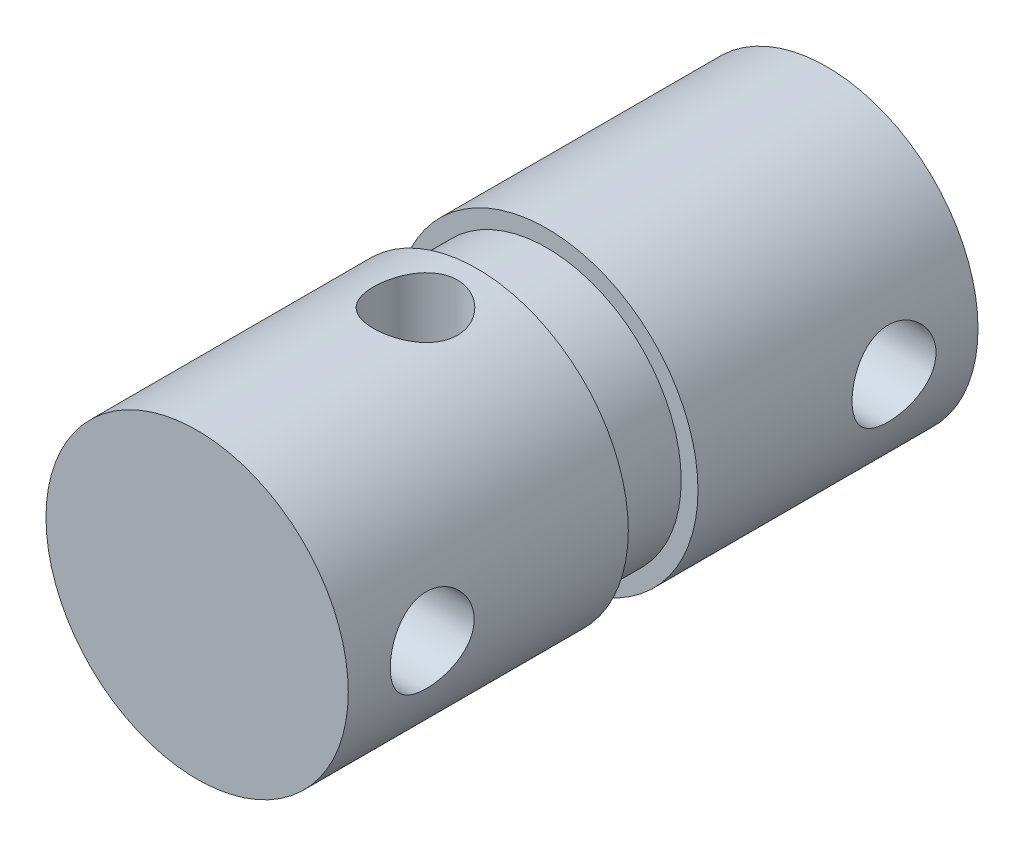
ISO-10303-21;
HEADER;
FILE_DESCRIPTION(('STEP AP214'),'2;1');
FILE_NAME('part.step','',(''),(''),'','','');
FILE_SCHEMA(('AUTOMOTIVE_DESIGN { 1 0 10303 214 1 1 1 1 }'));
ENDSEC;
DATA;
#1=APPLICATION_CONTEXT('core data for automotive mechanical design processes');
#2=APPLICATION_PROTOCOL_DEFINITION('international standard','automotive_design',2000,#1);
#3=PRODUCT_CONTEXT('',#1,'mechanical');
#4=PRODUCT('Part','Part','',(#3));
#5=PRODUCT_RELATED_PRODUCT_CATEGORY('part','',(#4));
#6=PRODUCT_DEFINITION_FORMATION('','',#4);
#7=PRODUCT_DEFINITION_CONTEXT('part definition',#1,'design');
#8=PRODUCT_DEFINITION('design','',#6,#7);
#9=PRODUCT_DEFINITION_SHAPE('','',#8);
#10=(LENGTH_UNIT() NAMED_UNIT(*) SI_UNIT(.MILLI.,.METRE.));
#11=(NAMED_UNIT(*) PLANE_ANGLE_UNIT() SI_UNIT($,.RADIAN.));
#12=(NAMED_UNIT(*) SI_UNIT($,.STERADIAN.) SOLID_ANGLE_UNIT());
#13=UNCERTAINTY_MEASURE_WITH_UNIT(LENGTH_MEASURE(1.E-05),#10,'distance_accuracy_value','');
#14=(GEOMETRIC_REPRESENTATION_CONTEXT(3) GLOBAL_UNCERTAINTY_ASSIGNED_CONTEXT((#13)) GLOBAL_UNIT_ASSIGNED_CONTEXT((#10,
#11,#12)) REPRESENTATION_CONTEXT('',''));
#15=CARTESIAN_POINT('',(0.,0.,0.));
#16=DIRECTION('',(0.,0.,1.));
#17=DIRECTION('',(1.,0.,0.));
#18=AXIS2_PLACEMENT_3D('',#15,#16,#17);
#19=CARTESIAN_POINT('',(0.,0.,0.));
#20=DIRECTION('',(0.,0.,-1.));
#21=DIRECTION('',(-1.,0.,0.));
#22=AXIS2_PLACEMENT_3D('',#19,#20,#21);
#23=CYLINDRICAL_SURFACE('',#22,4.572);
#24=CARTESIAN_POINT('',(0.,-4.572,13.716));
#25=CARTESIAN_POINT('',(0.0699020708973099,-4.571999065452,13.7159985780214));
#26=CARTESIAN_POINT('',(0.13981899773271,-4.57038124872222,13.7102094910778));
#27=CARTESIAN_POINT('',(0.277631627610146,-4.56408485401408,13.6872515400824));
#28=CARTESIAN_POINT('',(0.345526465322054,-4.55940498479641,13.6700778752189));
#29=CARTESIAN_POINT('',(0.477286268875187,-4.54749982440908,13.6249575410755));
#30=CARTESIAN_POINT('',(0.541156540337201,-4.54027797079459,13.5970254158024));
#31=CARTESIAN_POINT('',(0.663306466365641,-4.52404797583308,13.5312368375719));
#32=CARTESIAN_POINT('',(0.721585623945294,-4.51503967590907,13.49337950349));
#33=CARTESIAN_POINT('',(0.832354733271379,-4.4959540034257,13.4078172952157));
#34=CARTESIAN_POINT('',(0.88468516261341,-4.48585715601675,13.3599102476775));
#35=CARTESIAN_POINT('',(0.980681996667479,-4.46585448831132,13.2560402624445));
#36=CARTESIAN_POINT('',(1.02434718253907,-4.4559486950649,13.2000761933684));
#37=CARTESIAN_POINT('',(1.10257141517609,-4.4372483700326,13.0803830237086));
#38=CARTESIAN_POINT('',(1.13694336947003,-4.4284782951312,13.0165274762212));
#39=CARTESIAN_POINT('',(1.19439900445238,-4.41333027221237,12.8836603716776));
#40=CARTESIAN_POINT('',(1.21748496493622,-4.40695184113836,12.8146498591853));
#41=CARTESIAN_POINT('',(1.25115243157843,-4.39751097273163,12.6752067665242));
#42=CARTESIAN_POINT('',(1.26202477494765,-4.3943715617925,12.6048497492139));
#43=CARTESIAN_POINT('',(1.2718636191122,-4.39153451774961,12.4632457002682));
#44=CARTESIAN_POINT('',(1.2708325513174,-4.3918361817662,12.3919988533607));
#45=CARTESIAN_POINT('',(1.25712394079022,-4.39577852670277,12.2529373648177));
#46=CARTESIAN_POINT('',(1.24480220707002,-4.39931719239283,12.1850842896798));
#47=CARTESIAN_POINT('',(1.20943350901136,-4.40917093326331,12.0524487133509));
#48=CARTESIAN_POINT('',(1.18638562272472,-4.41548624710322,11.9876664766361));
#49=CARTESIAN_POINT('',(1.12993803104617,-4.43026870892164,11.8621025328414));
#50=CARTESIAN_POINT('',(1.09641662186383,-4.438760932978,11.801378615321));
#51=CARTESIAN_POINT('',(1.0200583173051,-4.45692733895248,11.6862945591993));
#52=CARTESIAN_POINT('',(0.977219448951252,-4.46660177101345,11.6319357721742));
#53=CARTESIAN_POINT('',(0.881639700048992,-4.48646369280857,11.5290966974766));
#54=CARTESIAN_POINT('',(0.828601116177594,-4.49665719958396,11.4808938429621));
#55=CARTESIAN_POINT('',(0.715067512916252,-4.51610171007802,11.3940074575297));
#56=CARTESIAN_POINT('',(0.654572148228716,-4.52535267011436,11.3553243676879));
#57=CARTESIAN_POINT('',(0.527388764207524,-4.54193493148159,11.2884388753198));
#58=CARTESIAN_POINT('',(0.460671058079712,-4.5492563182386,11.2602903023981));
#59=CARTESIAN_POINT('',(0.323199748590031,-4.56108300381469,11.2156909559836));
#60=CARTESIAN_POINT('',(0.25244710914707,-4.56558897216879,11.1992374011689));
#61=CARTESIAN_POINT('',(0.111279033436553,-4.57117436267143,11.1789391490326));
#62=CARTESIAN_POINT('',(0.0409217427524207,-4.57235614685215,11.1747176607743));
#63=CARTESIAN_POINT('',(-0.0994968095267519,-4.5714562397785,11.1779578302651));
#64=CARTESIAN_POINT('',(-0.16955810364107,-4.56937491689018,11.1854181692744));
#65=CARTESIAN_POINT('',(-0.306026224086394,-4.56224909299973,11.2115024274656));
#66=CARTESIAN_POINT('',(-0.372477068774489,-4.55726126562262,11.2299129681784));
#67=CARTESIAN_POINT('',(-0.50133820800862,-4.54489138436064,11.2771243775203));
#68=CARTESIAN_POINT('',(-0.56374804595594,-4.53750906048279,11.3059264178906));
#69=CARTESIAN_POINT('',(-0.684194862651903,-4.52093320128722,11.3737805320952));
#70=CARTESIAN_POINT('',(-0.742113894944799,-4.51170518882014,11.4130333327118));
#71=CARTESIAN_POINT('',(-0.850674113316392,-4.49250284762264,11.5004251939804));
#72=CARTESIAN_POINT('',(-0.901313731665477,-4.48252835882872,11.5485661637468));
#73=CARTESIAN_POINT('',(-0.99548901937607,-4.46257520167329,11.6541310669804));
#74=CARTESIAN_POINT('',(-1.03875797211549,-4.45260585939287,11.7117951707825));
#75=CARTESIAN_POINT('',(-1.11501510731872,-4.43412568397135,11.8337793680858));
#76=CARTESIAN_POINT('',(-1.14800368298183,-4.42561479505358,11.8980992068961));
#77=CARTESIAN_POINT('',(-1.202518355275,-4.41111435739472,12.0312760846013));
#78=CARTESIAN_POINT('',(-1.22410806724539,-4.40511085545577,12.1001054799587));
#79=CARTESIAN_POINT('',(-1.25534574935282,-4.39631202923068,12.2406153047674));
#80=CARTESIAN_POINT('',(-1.26499709313078,-4.39351579862405,12.3122949228672));
#81=CARTESIAN_POINT('',(-1.27187817733911,-4.39152830943153,12.4537274719626));
#82=CARTESIAN_POINT('',(-1.26953844150815,-4.39221209908555,12.5234580010521));
#83=CARTESIAN_POINT('',(-1.25351177579854,-4.39681251244957,12.6614884120954));
#84=CARTESIAN_POINT('',(-1.23982518658201,-4.40072903910437,12.7297883369365));
#85=CARTESIAN_POINT('',(-1.20175247836593,-4.41127610308931,12.8624251096608));
#86=CARTESIAN_POINT('',(-1.17746490075375,-4.41788160783887,12.9267923761301));
#87=CARTESIAN_POINT('',(-1.11895586897466,-4.43306114708886,13.0505885012674));
#88=CARTESIAN_POINT('',(-1.08473273892427,-4.44163551363682,13.1100165246295));
#89=CARTESIAN_POINT('',(-1.00605027341331,-4.46012631757945,13.2242840952704));
#90=CARTESIAN_POINT('',(-0.961300677695808,-4.47007669845978,13.2789183003097));
#91=CARTESIAN_POINT('',(-0.863378031889875,-4.49001725219912,13.3800416900063));
#92=CARTESIAN_POINT('',(-0.810202896358244,-4.50000743431116,13.4265288521372));
#93=CARTESIAN_POINT('',(-0.695411596024809,-4.51918669014853,13.5111318667633));
#94=CARTESIAN_POINT('',(-0.63362459907509,-4.52835102651876,13.5490220492837));
#95=CARTESIAN_POINT('',(-0.504303774415928,-4.54456774499014,13.6138189895181));
#96=CARTESIAN_POINT('',(-0.436773350659554,-4.55162136699901,13.6407321988783));
#97=CARTESIAN_POINT('',(-0.307995811506968,-4.56200332029261,13.6796476020265));
#98=CARTESIAN_POINT('',(-0.247258232603442,-4.56572361592445,13.6932464641944));
#99=CARTESIAN_POINT('',(-0.124350907704504,-4.57072222735905,13.7114227633557));
#100=CARTESIAN_POINT('',(-0.062181331587726,-4.57200083132643,13.7160012649199));
#101=CARTESIAN_POINT('',(0.,-4.572,13.716));
#102=B_SPLINE_CURVE_WITH_KNOTS('',3,(#24,#25,#26,#27,#28,#29,#30,#31,#32,#33,#34,#35,#36,#37,
#38,#39,#40,#41,#42,#43,#44,#45,#46,#47,#48,#49,#50,#51,#52,#53,#54,#55,#56,#57,#58,#59,#60,#61,
#62,#63,#64,#65,#66,#67,#68,#69,#70,#71,#72,#73,#74,#75,#76,#77,#78,#79,#80,#81,#82,#83,#84,#85,
#86,#87,#88,#89,#90,#91,#92,#93,#94,#95,#96,#97,#98,#99,#100,#101),.UNSPECIFIED.,.T.,.F.,(4,2,2,
2,2,2,2,2,2,2,2,2,2,2,2,2,2,2,2,2,2,2,2,2,2,2,2,2,2,2,2,2,2,2,2,2,2,2,4),(0.,0.209478060189082,
0.419044512325617,0.628328647269941,0.837631368003338,1.05163746314468,1.26567363876699,
1.48374293368851,1.70176815991518,1.91448366850216,2.12715572824691,2.33334796718268,
2.53955793229539,2.74825927401306,2.95700485146158,3.17316605739572,3.38933727676676,
3.60659848286125,3.82380800235607,4.03425162757841,4.24467149792453,4.45111954557126,
4.65759087949647,4.86835652066374,5.07916748554579,5.29646887570096,5.51376195358892,
5.72982917891636,5.94583533225543,6.15414160832217,6.36244163071789,6.56884531852922,
6.77528384181699,6.98827063886151,7.2013102358127,7.41942220034088,7.63740578557666,
7.82376882309431,8.01010986497998),.UNSPECIFIED.);
#103=CARTESIAN_POINT('',(0.,-4.572,13.716));
#104=VERTEX_POINT('',#103);
#105=EDGE_CURVE('E111',#104,#104,#102,.T.);
#106=ORIENTED_EDGE('',*,*,#105,.T.);
#107=EDGE_LOOP('',(#106));
#108=FACE_BOUND('',#107,.T.);
#109=CARTESIAN_POINT('',(0.,4.572,13.716));
#110=CARTESIAN_POINT('',(-0.0699020708973099,4.571999065452,13.7159985780214));
#111=CARTESIAN_POINT('',(-0.13981899773271,4.57038124872222,13.7102094910778));
#112=CARTESIAN_POINT('',(-0.277631627610146,4.56408485401408,13.6872515400824));
#113=CARTESIAN_POINT('',(-0.345526465322054,4.55940498479641,13.6700778752189));
#114=CARTESIAN_POINT('',(-0.477286268875187,4.54749982440908,13.6249575410755));
#115=CARTESIAN_POINT('',(-0.541156540337201,4.54027797079459,13.5970254158024));
#116=CARTESIAN_POINT('',(-0.663306466365641,4.52404797583308,13.5312368375719));
#117=CARTESIAN_POINT('',(-0.721585623945294,4.51503967590907,13.49337950349));
#118=CARTESIAN_POINT('',(-0.832354733271379,4.4959540034257,13.4078172952157));
#119=CARTESIAN_POINT('',(-0.88468516261341,4.48585715601675,13.3599102476775));
#120=CARTESIAN_POINT('',(-0.980681996667479,4.46585448831132,13.2560402624445));
#121=CARTESIAN_POINT('',(-1.02434718253907,4.4559486950649,13.2000761933684));
#122=CARTESIAN_POINT('',(-1.10257141517609,4.4372483700326,13.0803830237086));
#123=CARTESIAN_POINT('',(-1.13694336947003,4.4284782951312,13.0165274762212));
#124=CARTESIAN_POINT('',(-1.19439900445238,4.41333027221237,12.8836603716776));
#125=CARTESIAN_POINT('',(-1.21748496493622,4.40695184113836,12.8146498591853));
#126=CARTESIAN_POINT('',(-1.25115243157843,4.39751097273163,12.6752067665242));
#127=CARTESIAN_POINT('',(-1.26202477494765,4.3943715617925,12.6048497492139));
#128=CARTESIAN_POINT('',(-1.2718636191122,4.39153451774961,12.4632457002682));
#129=CARTESIAN_POINT('',(-1.2708325513174,4.3918361817662,12.3919988533607));
#130=CARTESIAN_POINT('',(-1.25712394079022,4.39577852670277,12.2529373648177));
#131=CARTESIAN_POINT('',(-1.24480220707002,4.39931719239283,12.1850842896798));
#132=CARTESIAN_POINT('',(-1.20943350901136,4.40917093326331,12.0524487133509));
#133=CARTESIAN_POINT('',(-1.18638562272472,4.41548624710322,11.9876664766361));
#134=CARTESIAN_POINT('',(-1.12993803104617,4.43026870892164,11.8621025328414));
#135=CARTESIAN_POINT('',(-1.09641662186383,4.438760932978,11.801378615321));
#136=CARTESIAN_POINT('',(-1.0200583173051,4.45692733895248,11.6862945591993));
#137=CARTESIAN_POINT('',(-0.977219448951252,4.46660177101345,11.6319357721742));
#138=CARTESIAN_POINT('',(-0.881639700048992,4.48646369280857,11.5290966974766));
#139=CARTESIAN_POINT('',(-0.828601116177594,4.49665719958396,11.4808938429621));
#140=CARTESIAN_POINT('',(-0.715067512916252,4.51610171007802,11.3940074575297));
#141=CARTESIAN_POINT('',(-0.654572148228716,4.52535267011436,11.3553243676879));
#142=CARTESIAN_POINT('',(-0.527388764207524,4.54193493148159,11.2884388753198));
#143=CARTESIAN_POINT('',(-0.460671058079712,4.5492563182386,11.2602903023981));
#144=CARTESIAN_POINT('',(-0.323199748590031,4.56108300381469,11.2156909559836));
#145=CARTESIAN_POINT('',(-0.25244710914707,4.56558897216879,11.1992374011689));
#146=CARTESIAN_POINT('',(-0.111279033436553,4.57117436267143,11.1789391490326));
#147=CARTESIAN_POINT('',(-0.0409217427524207,4.57235614685215,11.1747176607743));
#148=CARTESIAN_POINT('',(0.0994968095267519,4.5714562397785,11.1779578302651));
#149=CARTESIAN_POINT('',(0.16955810364107,4.56937491689018,11.1854181692744));
#150=CARTESIAN_POINT('',(0.306026224086394,4.56224909299973,11.2115024274656));
#151=CARTESIAN_POINT('',(0.372477068774489,4.55726126562262,11.2299129681784));
#152=CARTESIAN_POINT('',(0.50133820800862,4.54489138436064,11.2771243775203));
#153=CARTESIAN_POINT('',(0.56374804595594,4.53750906048279,11.3059264178906));
#154=CARTESIAN_POINT('',(0.684194862651903,4.52093320128722,11.3737805320952));
#155=CARTESIAN_POINT('',(0.742113894944799,4.51170518882014,11.4130333327118));
#156=CARTESIAN_POINT('',(0.850674113316392,4.49250284762264,11.5004251939804));
#157=CARTESIAN_POINT('',(0.901313731665477,4.48252835882872,11.5485661637468));
#158=CARTESIAN_POINT('',(0.99548901937607,4.46257520167329,11.6541310669804));
#159=CARTESIAN_POINT('',(1.03875797211549,4.45260585939287,11.7117951707825));
#160=CARTESIAN_POINT('',(1.11501510731872,4.43412568397135,11.8337793680858));
#161=CARTESIAN_POINT('',(1.14800368298183,4.42561479505358,11.8980992068961));
#162=CARTESIAN_POINT('',(1.202518355275,4.41111435739472,12.0312760846013));
#163=CARTESIAN_POINT('',(1.22410806724539,4.40511085545577,12.1001054799587));
#164=CARTESIAN_POINT('',(1.25534574935282,4.39631202923068,12.2406153047674));
#165=CARTESIAN_POINT('',(1.26499709313078,4.39351579862405,12.3122949228672));
#166=CARTESIAN_POINT('',(1.27187817733911,4.39152830943153,12.4537274719626));
#167=CARTESIAN_POINT('',(1.26953844150815,4.39221209908555,12.5234580010521));
#168=CARTESIAN_POINT('',(1.25351177579854,4.39681251244957,12.6614884120954));
#169=CARTESIAN_POINT('',(1.23982518658201,4.40072903910437,12.7297883369365));
#170=CARTESIAN_POINT('',(1.20175247836593,4.41127610308931,12.8624251096608));
#171=CARTESIAN_POINT('',(1.17746490075375,4.41788160783887,12.9267923761301));
#172=CARTESIAN_POINT('',(1.11895586897466,4.43306114708886,13.0505885012674));
#173=CARTESIAN_POINT('',(1.08473273892427,4.44163551363682,13.1100165246295));
#174=CARTESIAN_POINT('',(1.00605027341331,4.46012631757945,13.2242840952704));
#175=CARTESIAN_POINT('',(0.961300677695808,4.47007669845978,13.2789183003097));
#176=CARTESIAN_POINT('',(0.863378031889875,4.49001725219912,13.3800416900063));
#177=CARTESIAN_POINT('',(0.810202896358244,4.50000743431116,13.4265288521372));
#178=CARTESIAN_POINT('',(0.695411596024809,4.51918669014853,13.5111318667633));
#179=CARTESIAN_POINT('',(0.63362459907509,4.52835102651876,13.5490220492837));
#180=CARTESIAN_POINT('',(0.504303774415928,4.54456774499014,13.6138189895181));
#181=CARTESIAN_POINT('',(0.436773350659554,4.55162136699901,13.6407321988783));
#182=CARTESIAN_POINT('',(0.307995811506968,4.56200332029261,13.6796476020265));
#183=CARTESIAN_POINT('',(0.247258232603442,4.56572361592445,13.6932464641944));
#184=CARTESIAN_POINT('',(0.124350907704504,4.57072222735905,13.7114227633557));
#185=CARTESIAN_POINT('',(0.062181331587726,4.57200083132643,13.7160012649199));
#186=CARTESIAN_POINT('',(0.,4.572,13.716));
#187=B_SPLINE_CURVE_WITH_KNOTS('',3,(#109,#110,#111,#112,#113,#114,#115,#116,#117,#118,#119,
#120,#121,#122,#123,#124,#125,#126,#127,#128,#129,#130,#131,#132,#133,#134,#135,#136,#137,#138,
#139,#140,#141,#142,#143,#144,#145,#146,#147,#148,#149,#150,#151,#152,#153,#154,#155,#156,#157,
#158,#159,#160,#161,#162,#163,#164,#165,#166,#167,#168,#169,#170,#171,#172,#173,#174,#175,#176,
#177,#178,#179,#180,#181,#182,#183,#184,#185,#186),.UNSPECIFIED.,.T.,.F.,(4,2,2,2,2,2,2,2,2,2,2,
2,2,2,2,2,2,2,2,2,2,2,2,2,2,2,2,2,2,2,2,2,2,2,2,2,2,2,4),(0.,0.209478060189082,
0.419044512325617,0.628328647269941,0.837631368003338,1.05163746314468,1.26567363876699,
1.48374293368851,1.70176815991518,1.91448366850216,2.12715572824691,2.33334796718268,
2.53955793229539,2.74825927401306,2.95700485146158,3.17316605739572,3.38933727676676,
3.60659848286125,3.82380800235607,4.03425162757841,4.24467149792453,4.45111954557126,
4.65759087949647,4.86835652066374,5.07916748554579,5.29646887570096,5.51376195358892,
5.72982917891636,5.94583533225543,6.15414160832217,6.36244163071789,6.56884531852922,
6.77528384181699,6.98827063886151,7.2013102358127,7.41942220034088,7.63740578557666,
7.82376882309431,8.01010986497998),.UNSPECIFIED.);
#188=CARTESIAN_POINT('',(0.,4.572,13.716));
#189=VERTEX_POINT('',#188);
#190=EDGE_CURVE('E105',#189,#189,#187,.T.);
#191=ORIENTED_EDGE('',*,*,#190,.T.);
#192=EDGE_LOOP('',(#191));
#193=FACE_BOUND('',#192,.T.);
#194=CARTESIAN_POINT('',(0.,0.,10.5791));
#195=DIRECTION('',(0.,0.,-1.));
#196=DIRECTION('',(-1.,0.,0.));
#197=AXIS2_PLACEMENT_3D('',#194,#195,#196);
#198=CIRCLE('',#197,4.572);
#199=CARTESIAN_POINT('',(-4.572,0.,10.5791));
#200=VERTEX_POINT('',#199);
#201=EDGE_CURVE('E146',#200,#200,#198,.T.);
#202=ORIENTED_EDGE('',*,*,#201,.F.);
#203=EDGE_LOOP('',(#202));
#204=FACE_BOUND('',#203,.T.);
#205=CARTESIAN_POINT('',(0.,0.,19.05));
#206=DIRECTION('',(0.,0.,-1.));
#207=DIRECTION('',(-1.,0.,0.));
#208=AXIS2_PLACEMENT_3D('',#205,#206,#207);
#209=CIRCLE('',#208,4.572);
#210=CARTESIAN_POINT('',(-4.572,0.,19.05));
#211=VERTEX_POINT('',#210);
#212=EDGE_CURVE('E150',#211,#211,#209,.T.);
#213=ORIENTED_EDGE('',*,*,#212,.T.);
#214=EDGE_LOOP('',(#213));
#215=FACE_BOUND('',#214,.T.);
#216=CARTESIAN_POINT('',(4.572,0.,15.24));
#217=CARTESIAN_POINT('',(4.571999065452,0.06990207089731,15.2400014219786));
#218=CARTESIAN_POINT('',(4.57038124872222,0.13981899773271,15.2457905089222));
#219=CARTESIAN_POINT('',(4.56408485401408,0.277631627610146,15.2687484599176));
#220=CARTESIAN_POINT('',(4.55940498479641,0.345526465322054,15.2859221247811));
#221=CARTESIAN_POINT('',(4.54749982440908,0.477286268875186,15.3310424589245));
#222=CARTESIAN_POINT('',(4.54027797079459,0.5411565403372,15.3589745841976));
#223=CARTESIAN_POINT('',(4.52404797583308,0.66330646636564,15.4247631624281));
#224=CARTESIAN_POINT('',(4.51503967590907,0.721585623945294,15.46262049651));
#225=CARTESIAN_POINT('',(4.4959540034257,0.832354733271379,15.5481827047843));
#226=CARTESIAN_POINT('',(4.48585715601675,0.88468516261341,15.5960897523225));
#227=CARTESIAN_POINT('',(4.46585448831132,0.98068199666748,15.6999597375555));
#228=CARTESIAN_POINT('',(4.4559486950649,1.02434718253907,15.7559238066316));
#229=CARTESIAN_POINT('',(4.4372483700326,1.10257141517609,15.8756169762914));
#230=CARTESIAN_POINT('',(4.4284782951312,1.13694336947003,15.9394725237788));
#231=CARTESIAN_POINT('',(4.41333027221237,1.19439900445238,16.0723396283224));
#232=CARTESIAN_POINT('',(4.40695184113836,1.21748496493622,16.1413501408147));
#233=CARTESIAN_POINT('',(4.39751097273163,1.25115243157843,16.2807932334758));
#234=CARTESIAN_POINT('',(4.39437156179249,1.26202477494765,16.3511502507861));
#235=CARTESIAN_POINT('',(4.3915345177496,1.2718636191122,16.4927542997318));
#236=CARTESIAN_POINT('',(4.3918361817662,1.2708325513174,16.5640011466393));
#237=CARTESIAN_POINT('',(4.39577852670277,1.25712394079022,16.7030626351823));
#238=CARTESIAN_POINT('',(4.39931719239283,1.24480220707002,16.7709157103201));
#239=CARTESIAN_POINT('',(4.40917093326331,1.20943350901136,16.9035512866491));
#240=CARTESIAN_POINT('',(4.41548624710322,1.18638562272472,16.9683335233639));
#241=CARTESIAN_POINT('',(4.43026870892164,1.12993803104617,17.0938974671586));
#242=CARTESIAN_POINT('',(4.438760932978,1.09641662186383,17.154621384679));
#243=CARTESIAN_POINT('',(4.45692733895248,1.0200583173051,17.2697054408007));
#244=CARTESIAN_POINT('',(4.46660177101345,0.977219448951252,17.3240642278258));
#245=CARTESIAN_POINT('',(4.48646369280857,0.881639700048992,17.4269033025234));
#246=CARTESIAN_POINT('',(4.49665719958396,0.828601116177594,17.4751061570379));
#247=CARTESIAN_POINT('',(4.51610171007802,0.715067512916252,17.5619925424703));
#248=CARTESIAN_POINT('',(4.52535267011436,0.654572148228716,17.6006756323121));
#249=CARTESIAN_POINT('',(4.54193493148159,0.527388764207524,17.6675611246802));
#250=CARTESIAN_POINT('',(4.5492563182386,0.460671058079711,17.6957096976019));
#251=CARTESIAN_POINT('',(4.56108300381469,0.323199748590031,17.7403090440164));
#252=CARTESIAN_POINT('',(4.56558897216879,0.252447109147069,17.7567625988311));
#253=CARTESIAN_POINT('',(4.57117436267143,0.111279033436553,17.7770608509674));
#254=CARTESIAN_POINT('',(4.57235614685215,0.0409217427524208,17.7812823392257));
#255=CARTESIAN_POINT('',(4.5714562397785,-0.0994968095267517,17.7780421697349));
#256=CARTESIAN_POINT('',(4.56937491689018,-0.16955810364107,17.7705818307256));
#257=CARTESIAN_POINT('',(4.56224909299973,-0.306026224086394,17.7444975725345));
#258=CARTESIAN_POINT('',(4.55726126562262,-0.372477068774489,17.7260870318216));
#259=CARTESIAN_POINT('',(4.54489138436064,-0.501338208008621,17.6788756224797));
#260=CARTESIAN_POINT('',(4.53750906048279,-0.56374804595594,17.6500735821094));
#261=CARTESIAN_POINT('',(4.52093320128722,-0.684194862651903,17.5822194679048));
#262=CARTESIAN_POINT('',(4.51170518882014,-0.742113894944799,17.5429666672882));
#263=CARTESIAN_POINT('',(4.49250284762264,-0.850674113316393,17.4555748060196));
#264=CARTESIAN_POINT('',(4.48252835882872,-0.901313731665478,17.4074338362532));
#265=CARTESIAN_POINT('',(4.46257520167329,-0.99548901937607,17.3018689330196));
#266=CARTESIAN_POINT('',(4.45260585939287,-1.03875797211549,17.2442048292175));
#267=CARTESIAN_POINT('',(4.43412568397135,-1.11501510731872,17.1222206319142));
#268=CARTESIAN_POINT('',(4.42561479505358,-1.14800368298183,17.0579007931039));
#269=CARTESIAN_POINT('',(4.41111435739472,-1.202518355275,16.9247239153987));
#270=CARTESIAN_POINT('',(4.40511085545577,-1.22410806724539,16.8558945200413));
#271=CARTESIAN_POINT('',(4.39631202923068,-1.25534574935282,16.7153846952326));
#272=CARTESIAN_POINT('',(4.39351579862405,-1.26499709313078,16.6437050771328));
#273=CARTESIAN_POINT('',(4.39152830943153,-1.27187817733911,16.5022725280374));
#274=CARTESIAN_POINT('',(4.39221209908555,-1.26953844150815,16.4325419989479));
#275=CARTESIAN_POINT('',(4.39681251244957,-1.25351177579855,16.2945115879046));
#276=CARTESIAN_POINT('',(4.40072903910437,-1.23982518658201,16.2262116630635));
#277=CARTESIAN_POINT('',(4.41127610308931,-1.20175247836592,16.0935748903392));
#278=CARTESIAN_POINT('',(4.41788160783887,-1.17746490075375,16.0292076238699));
#279=CARTESIAN_POINT('',(4.43306114708886,-1.11895586897466,15.9054114987326));
#280=CARTESIAN_POINT('',(4.44163551363682,-1.08473273892427,15.8459834753705));
#281=CARTESIAN_POINT('',(4.46012631757945,-1.00605027341331,15.7317159047296));
#282=CARTESIAN_POINT('',(4.47007669845978,-0.961300677695808,15.6770816996904));
#283=CARTESIAN_POINT('',(4.49001725219912,-0.863378031889875,15.5759583099937));
#284=CARTESIAN_POINT('',(4.50000743431116,-0.810202896358243,15.5294711478628));
#285=CARTESIAN_POINT('',(4.51918669014853,-0.695411596024809,15.4448681332367));
#286=CARTESIAN_POINT('',(4.52835102651876,-0.63362459907509,15.4069779507163));
#287=CARTESIAN_POINT('',(4.54456774499014,-0.504303774415928,15.3421810104819));
#288=CARTESIAN_POINT('',(4.55162136699901,-0.436773350659553,15.3152678011217));
#289=CARTESIAN_POINT('',(4.56200332029261,-0.307995811506968,15.2763523979735));
#290=CARTESIAN_POINT('',(4.56572361592445,-0.247258232603442,15.2627535358056));
#291=CARTESIAN_POINT('',(4.57072222735905,-0.124350907704504,15.2445772366443));
#292=CARTESIAN_POINT('',(4.57200083132643,-0.062181331587726,15.2399987350801));
#293=CARTESIAN_POINT('',(4.572,0.,15.24));
#294=B_SPLINE_CURVE_WITH_KNOTS('',3,(#216,#217,#218,#219,#220,#221,#222,#223,#224,#225,#226,
#227,#228,#229,#230,#231,#232,#233,#234,#235,#236,#237,#238,#239,#240,#241,#242,#243,#244,#245,
#246,#247,#248,#249,#250,#251,#252,#253,#254,#255,#256,#257,#258,#259,#260,#261,#262,#263,#264,
#265,#266,#267,#268,#269,#270,#271,#272,#273,#274,#275,#276,#277,#278,#279,#280,#281,#282,#283,
#284,#285,#286,#287,#288,#289,#290,#291,#292,#293),.UNSPECIFIED.,.T.,.F.,(4,2,2,2,2,2,2,2,2,2,2,
2,2,2,2,2,2,2,2,2,2,2,2,2,2,2,2,2,2,2,2,2,2,2,2,2,2,2,4),(0.,0.209478060189082,
0.419044512325617,0.62832864726994,0.837631368003339,1.05163746314468,1.26567363876699,
1.48374293368851,1.70176815991519,1.91448366850216,2.12715572824691,2.33334796718268,
2.5395579322954,2.74825927401306,2.95700485146158,3.17316605739572,3.38933727676677,
3.60659848286125,3.82380800235607,4.03425162757842,4.24467149792453,4.45111954557127,
4.65759087949648,4.86835652066374,5.0791674855458,5.29646887570097,5.51376195358892,
5.72982917891636,5.94583533225544,6.15414160832217,6.3624416307179,6.56884531852922,
6.775283841817,6.98827063886152,7.20131023581271,7.41942220034089,7.63740578557667,
7.82376882309431,8.01010986497998),.UNSPECIFIED.);
#295=CARTESIAN_POINT('',(4.572,0.,15.24));
#296=VERTEX_POINT('',#295);
#297=EDGE_CURVE('E66',#296,#296,#294,.T.);
#298=ORIENTED_EDGE('',*,*,#297,.F.);
#299=EDGE_LOOP('',(#298));
#300=FACE_BOUND('',#299,.T.);
#301=CARTESIAN_POINT('',(-4.572,0.,15.24));
#302=CARTESIAN_POINT('',(-4.571999065452,-0.0699020708973101,15.2400014219786));
#303=CARTESIAN_POINT('',(-4.57038124872222,-0.13981899773271,15.2457905089222));
#304=CARTESIAN_POINT('',(-4.56408485401408,-0.277631627610146,15.2687484599176));
#305=CARTESIAN_POINT('',(-4.55940498479641,-0.345526465322054,15.2859221247811));
#306=CARTESIAN_POINT('',(-4.54749982440908,-0.477286268875186,15.3310424589245));
#307=CARTESIAN_POINT('',(-4.54027797079459,-0.5411565403372,15.3589745841976));
#308=CARTESIAN_POINT('',(-4.52404797583308,-0.66330646636564,15.4247631624281));
#309=CARTESIAN_POINT('',(-4.51503967590907,-0.721585623945294,15.46262049651));
#310=CARTESIAN_POINT('',(-4.4959540034257,-0.832354733271379,15.5481827047843));
#311=CARTESIAN_POINT('',(-4.48585715601675,-0.88468516261341,15.5960897523225));
#312=CARTESIAN_POINT('',(-4.46585448831132,-0.98068199666748,15.6999597375555));
#313=CARTESIAN_POINT('',(-4.4559486950649,-1.02434718253907,15.7559238066316));
#314=CARTESIAN_POINT('',(-4.4372483700326,-1.10257141517609,15.8756169762914));
#315=CARTESIAN_POINT('',(-4.4284782951312,-1.13694336947003,15.9394725237788));
#316=CARTESIAN_POINT('',(-4.41333027221237,-1.19439900445238,16.0723396283224));
#317=CARTESIAN_POINT('',(-4.40695184113836,-1.21748496493622,16.1413501408147));
#318=CARTESIAN_POINT('',(-4.39751097273163,-1.25115243157843,16.2807932334758));
#319=CARTESIAN_POINT('',(-4.39437156179249,-1.26202477494765,16.3511502507861));
#320=CARTESIAN_POINT('',(-4.3915345177496,-1.2718636191122,16.4927542997318));
#321=CARTESIAN_POINT('',(-4.3918361817662,-1.2708325513174,16.5640011466393));
#322=CARTESIAN_POINT('',(-4.39577852670277,-1.25712394079022,16.7030626351823));
#323=CARTESIAN_POINT('',(-4.39931719239283,-1.24480220707002,16.7709157103201));
#324=CARTESIAN_POINT('',(-4.40917093326331,-1.20943350901136,16.9035512866491));
#325=CARTESIAN_POINT('',(-4.41548624710322,-1.18638562272472,16.9683335233639));
#326=CARTESIAN_POINT('',(-4.43026870892164,-1.12993803104617,17.0938974671586));
#327=CARTESIAN_POINT('',(-4.438760932978,-1.09641662186383,17.154621384679));
#328=CARTESIAN_POINT('',(-4.45692733895248,-1.0200583173051,17.2697054408007));
#329=CARTESIAN_POINT('',(-4.46660177101345,-0.977219448951252,17.3240642278258));
#330=CARTESIAN_POINT('',(-4.48646369280857,-0.881639700048992,17.4269033025234));
#331=CARTESIAN_POINT('',(-4.49665719958396,-0.828601116177594,17.4751061570379));
#332=CARTESIAN_POINT('',(-4.51610171007802,-0.715067512916252,17.5619925424703));
#333=CARTESIAN_POINT('',(-4.52535267011436,-0.654572148228716,17.6006756323121));
#334=CARTESIAN_POINT('',(-4.54193493148159,-0.527388764207524,17.6675611246802));
#335=CARTESIAN_POINT('',(-4.5492563182386,-0.460671058079711,17.6957096976019));
#336=CARTESIAN_POINT('',(-4.56108300381469,-0.323199748590031,17.7403090440164));
#337=CARTESIAN_POINT('',(-4.56558897216879,-0.252447109147069,17.7567625988311));
#338=CARTESIAN_POINT('',(-4.57117436267143,-0.111279033436553,17.7770608509674));
#339=CARTESIAN_POINT('',(-4.57235614685215,-0.0409217427524207,17.7812823392257));
#340=CARTESIAN_POINT('',(-4.5714562397785,0.0994968095267518,17.7780421697349));
#341=CARTESIAN_POINT('',(-4.56937491689018,0.16955810364107,17.7705818307256));
#342=CARTESIAN_POINT('',(-4.56224909299973,0.306026224086394,17.7444975725345));
#343=CARTESIAN_POINT('',(-4.55726126562262,0.372477068774489,17.7260870318216));
#344=CARTESIAN_POINT('',(-4.54489138436064,0.501338208008621,17.6788756224797));
#345=CARTESIAN_POINT('',(-4.53750906048279,0.56374804595594,17.6500735821094));
#346=CARTESIAN_POINT('',(-4.52093320128722,0.684194862651903,17.5822194679048));
#347=CARTESIAN_POINT('',(-4.51170518882014,0.742113894944799,17.5429666672882));
#348=CARTESIAN_POINT('',(-4.49250284762264,0.850674113316393,17.4555748060196));
#349=CARTESIAN_POINT('',(-4.48252835882872,0.901313731665477,17.4074338362532));
#350=CARTESIAN_POINT('',(-4.46257520167329,0.995489019376071,17.3018689330196));
#351=CARTESIAN_POINT('',(-4.45260585939287,1.03875797211549,17.2442048292175));
#352=CARTESIAN_POINT('',(-4.43412568397135,1.11501510731872,17.1222206319142));
#353=CARTESIAN_POINT('',(-4.42561479505358,1.14800368298183,17.0579007931039));
#354=CARTESIAN_POINT('',(-4.41111435739472,1.202518355275,16.9247239153987));
#355=CARTESIAN_POINT('',(-4.40511085545577,1.22410806724539,16.8558945200413));
#356=CARTESIAN_POINT('',(-4.39631202923068,1.25534574935282,16.7153846952326));
#357=CARTESIAN_POINT('',(-4.39351579862405,1.26499709313078,16.6437050771328));
#358=CARTESIAN_POINT('',(-4.39152830943153,1.27187817733911,16.5022725280374));
#359=CARTESIAN_POINT('',(-4.39221209908555,1.26953844150815,16.4325419989479));
#360=CARTESIAN_POINT('',(-4.39681251244957,1.25351177579855,16.2945115879046));
#361=CARTESIAN_POINT('',(-4.40072903910437,1.23982518658201,16.2262116630635));
#362=CARTESIAN_POINT('',(-4.41127610308931,1.20175247836592,16.0935748903392));
#363=CARTESIAN_POINT('',(-4.41788160783887,1.17746490075375,16.0292076238699));
#364=CARTESIAN_POINT('',(-4.43306114708886,1.11895586897466,15.9054114987326));
#365=CARTESIAN_POINT('',(-4.44163551363682,1.08473273892427,15.8459834753705));
#366=CARTESIAN_POINT('',(-4.46012631757945,1.00605027341331,15.7317159047296));
#367=CARTESIAN_POINT('',(-4.47007669845978,0.961300677695808,15.6770816996904));
#368=CARTESIAN_POINT('',(-4.49001725219912,0.863378031889874,15.5759583099937));
#369=CARTESIAN_POINT('',(-4.50000743431116,0.810202896358243,15.5294711478628));
#370=CARTESIAN_POINT('',(-4.51918669014853,0.695411596024808,15.4448681332367));
#371=CARTESIAN_POINT('',(-4.52835102651876,0.633624599075089,15.4069779507163));
#372=CARTESIAN_POINT('',(-4.54456774499014,0.504303774415927,15.3421810104819));
#373=CARTESIAN_POINT('',(-4.55162136699901,0.436773350659553,15.3152678011217));
#374=CARTESIAN_POINT('',(-4.56200332029261,0.307995811506968,15.2763523979735));
#375=CARTESIAN_POINT('',(-4.56572361592445,0.247258232603441,15.2627535358056));
#376=CARTESIAN_POINT('',(-4.57072222735905,0.124350907704503,15.2445772366443));
#377=CARTESIAN_POINT('',(-4.57200083132643,0.0621813315877258,15.2399987350801));
#378=CARTESIAN_POINT('',(-4.572,0.,15.24));
#379=B_SPLINE_CURVE_WITH_KNOTS('',3,(#301,#302,#303,#304,#305,#306,#307,#308,#309,#310,#311,
#312,#313,#314,#315,#316,#317,#318,#319,#320,#321,#322,#323,#324,#325,#326,#327,#328,#329,#330,
#331,#332,#333,#334,#335,#336,#337,#338,#339,#340,#341,#342,#343,#344,#345,#346,#347,#348,#349,
#350,#351,#352,#353,#354,#355,#356,#357,#358,#359,#360,#361,#362,#363,#364,#365,#366,#367,#368,
#369,#370,#371,#372,#373,#374,#375,#376,#377,#378),.UNSPECIFIED.,.T.,.F.,(4,2,2,2,2,2,2,2,2,2,2,
2,2,2,2,2,2,2,2,2,2,2,2,2,2,2,2,2,2,2,2,2,2,2,2,2,2,2,4),(0.,0.209478060189082,
0.419044512325617,0.62832864726994,0.837631368003339,1.05163746314468,1.26567363876699,
1.48374293368851,1.70176815991519,1.91448366850216,2.12715572824691,2.33334796718268,
2.5395579322954,2.74825927401306,2.95700485146158,3.17316605739572,3.38933727676677,
3.60659848286125,3.82380800235607,4.03425162757842,4.24467149792453,4.45111954557126,
4.65759087949648,4.86835652066374,5.0791674855458,5.29646887570097,5.51376195358892,
5.72982917891636,5.94583533225544,6.15414160832217,6.3624416307179,6.56884531852922,
6.77528384181699,6.98827063886152,7.20131023581271,7.41942220034089,7.63740578557667,
7.82376882309431,8.01010986497998),.UNSPECIFIED.);
#380=CARTESIAN_POINT('',(-4.572,0.,15.24));
#381=VERTEX_POINT('',#380);
#382=EDGE_CURVE('E11',#381,#381,#379,.T.);
#383=ORIENTED_EDGE('',*,*,#382,.F.);
#384=EDGE_LOOP('',(#383));
#385=FACE_BOUND('',#384,.T.);
#386=ADVANCED_FACE('F53',(#108,#193,#204,#215,#300,#385),#23,.T.);
#387=CARTESIAN_POINT('',(4.572,0.,0.));
#388=DIRECTION('',(0.,0.,1.));
#389=DIRECTION('',(1.,0.,0.));
#390=AXIS2_PLACEMENT_3D('',#387,#388,#389);
#391=PLANE('',#390);
#392=CARTESIAN_POINT('',(0.,0.,0.));
#393=DIRECTION('',(0.,0.,-1.));
#394=DIRECTION('',(-1.,0.,0.));
#395=AXIS2_PLACEMENT_3D('',#392,#393,#394);
#396=CIRCLE('',#395,4.572);
#397=CARTESIAN_POINT('',(-4.572,0.,0.));
#398=VERTEX_POINT('',#397);
#399=EDGE_CURVE('E170',#398,#398,#396,.T.);
#400=ORIENTED_EDGE('',*,*,#399,.T.);
#401=EDGE_LOOP('',(#400));
#402=FACE_BOUND('',#401,.T.);
#403=ADVANCED_FACE('F55',(#402),#391,.F.);
#404=CARTESIAN_POINT('',(0.,0.,19.05));
#405=DIRECTION('',(0.,0.,-1.));
#406=DIRECTION('',(-1.,0.,0.));
#407=AXIS2_PLACEMENT_3D('',#404,#405,#406);
#408=PLANE('',#407);
#409=ORIENTED_EDGE('',*,*,#212,.F.);
#410=EDGE_LOOP('',(#409));
#411=FACE_BOUND('',#410,.T.);
#412=ADVANCED_FACE('F136',(#411),#408,.F.);
#413=CARTESIAN_POINT('',(4.572,0.,10.5791));
#414=DIRECTION('',(0.,0.,1.));
#415=DIRECTION('',(1.,0.,0.));
#416=AXIS2_PLACEMENT_3D('',#413,#414,#415);
#417=PLANE('',#416);
#418=CARTESIAN_POINT('',(0.,0.,10.5791));
#419=DIRECTION('',(0.,0.,-1.));
#420=DIRECTION('',(-1.,0.,0.));
#421=AXIS2_PLACEMENT_3D('',#418,#419,#420);
#422=CIRCLE('',#421,4.064);
#423=CARTESIAN_POINT('',(-4.064,0.,10.5791));
#424=VERTEX_POINT('',#423);
#425=EDGE_CURVE('E156',#424,#424,#422,.T.);
#426=ORIENTED_EDGE('',*,*,#425,.F.);
#427=EDGE_LOOP('',(#426));
#428=FACE_BOUND('',#427,.T.);
#429=ORIENTED_EDGE('',*,*,#201,.T.);
#430=EDGE_LOOP('',(#429));
#431=FACE_BOUND('',#430,.T.);
#432=ADVANCED_FACE('F187',(#428,#431),#417,.F.);
#433=CARTESIAN_POINT('',(0.,0.,0.));
#434=DIRECTION('',(0.,0.,-1.));
#435=DIRECTION('',(-1.,0.,0.));
#436=AXIS2_PLACEMENT_3D('',#433,#434,#435);
#437=CYLINDRICAL_SURFACE('',#436,4.064);
#438=CARTESIAN_POINT('',(0.,0.,8.4709));
#439=DIRECTION('',(0.,0.,-1.));
#440=DIRECTION('',(-1.,0.,0.));
#441=AXIS2_PLACEMENT_3D('',#438,#439,#440);
#442=CIRCLE('',#441,4.064);
#443=CARTESIAN_POINT('',(-4.064,0.,8.4709));
#444=VERTEX_POINT('',#443);
#445=EDGE_CURVE('E162',#444,#444,#442,.T.);
#446=ORIENTED_EDGE('',*,*,#445,.F.);
#447=EDGE_LOOP('',(#446));
#448=FACE_BOUND('',#447,.T.);
#449=ORIENTED_EDGE('',*,*,#425,.T.);
#450=EDGE_LOOP('',(#449));
#451=FACE_BOUND('',#450,.T.);
#452=ADVANCED_FACE('F182',(#448,#451),#437,.T.);
#453=CARTESIAN_POINT('',(4.064,0.,8.4709));
#454=DIRECTION('',(0.,0.,-1.));
#455=DIRECTION('',(-1.,0.,0.));
#456=AXIS2_PLACEMENT_3D('',#453,#454,#455);
#457=PLANE('',#456);
#458=CARTESIAN_POINT('',(0.,0.,8.4709));
#459=DIRECTION('',(0.,0.,-1.));
#460=DIRECTION('',(-1.,0.,0.));
#461=AXIS2_PLACEMENT_3D('',#458,#459,#460);
#462=CIRCLE('',#461,4.572);
#463=CARTESIAN_POINT('',(-4.572,0.,8.4709));
#464=VERTEX_POINT('',#463);
#465=EDGE_CURVE('E166',#464,#464,#462,.T.);
#466=ORIENTED_EDGE('',*,*,#465,.F.);
#467=EDGE_LOOP('',(#466));
#468=FACE_BOUND('',#467,.T.);
#469=ORIENTED_EDGE('',*,*,#445,.T.);
#470=EDGE_LOOP('',(#469));
#471=FACE_BOUND('',#470,.T.);
#472=ADVANCED_FACE('F176',(#468,#471),#457,.F.);
#473=CARTESIAN_POINT('',(0.,0.,0.));
#474=DIRECTION('',(0.,0.,-1.));
#475=DIRECTION('',(-1.,0.,0.));
#476=AXIS2_PLACEMENT_3D('',#473,#474,#475);
#477=CYLINDRICAL_SURFACE('',#476,4.572);
#478=CARTESIAN_POINT('',(4.572,0.,1.27));
#479=CARTESIAN_POINT('',(4.571999065452,-0.06990207089731,1.27000142197859));
#480=CARTESIAN_POINT('',(4.57038124872222,-0.13981899773271,1.27579050892218));
#481=CARTESIAN_POINT('',(4.56408485401408,-0.277631627610146,1.29874845991756));
#482=CARTESIAN_POINT('',(4.55940498479641,-0.345526465322054,1.31592212478114));
#483=CARTESIAN_POINT('',(4.54749982440908,-0.477286268875186,1.36104245892455));
#484=CARTESIAN_POINT('',(4.54027797079459,-0.5411565403372,1.38897458419759));
#485=CARTESIAN_POINT('',(4.52404797583308,-0.66330646636564,1.4547631624281));
#486=CARTESIAN_POINT('',(4.51503967590907,-0.721585623945294,1.49262049650996));
#487=CARTESIAN_POINT('',(4.4959540034257,-0.832354733271379,1.57818270478435));
#488=CARTESIAN_POINT('',(4.48585715601675,-0.884685162613409,1.62608975232255));
#489=CARTESIAN_POINT('',(4.46585448831132,-0.980681996667479,1.72995973755554));
#490=CARTESIAN_POINT('',(4.4559486950649,-1.02434718253907,1.78592380663164));
#491=CARTESIAN_POINT('',(4.4372483700326,-1.10257141517609,1.90561697629139));
#492=CARTESIAN_POINT('',(4.4284782951312,-1.13694336947003,1.96947252377882));
#493=CARTESIAN_POINT('',(4.41333027221237,-1.19439900445238,2.10233962832236));
#494=CARTESIAN_POINT('',(4.40695184113836,-1.21748496493622,2.17135014081469));
#495=CARTESIAN_POINT('',(4.39751097273163,-1.25115243157843,2.31079323347579));
#496=CARTESIAN_POINT('',(4.39437156179249,-1.26202477494765,2.38115025078612));
#497=CARTESIAN_POINT('',(4.3915345177496,-1.2718636191122,2.52275429973183));
#498=CARTESIAN_POINT('',(4.3918361817662,-1.2708325513174,2.5940011466393));
#499=CARTESIAN_POINT('',(4.39577852670277,-1.25712394079022,2.73306263518227));
#500=CARTESIAN_POINT('',(4.39931719239283,-1.24480220707002,2.80091571032015));
#501=CARTESIAN_POINT('',(4.40917093326331,-1.20943350901136,2.93355128664906));
#502=CARTESIAN_POINT('',(4.41548624710322,-1.18638562272472,2.99833352336389));
#503=CARTESIAN_POINT('',(4.43026870892164,-1.12993803104617,3.12389746715856));
#504=CARTESIAN_POINT('',(4.438760932978,-1.09641662186383,3.18462138467901));
#505=CARTESIAN_POINT('',(4.45692733895248,-1.0200583173051,3.2997054408007));
#506=CARTESIAN_POINT('',(4.46660177101344,-0.977219448951252,3.35406422782575));
#507=CARTESIAN_POINT('',(4.48646369280857,-0.881639700048992,3.4569033025234));
#508=CARTESIAN_POINT('',(4.49665719958396,-0.828601116177594,3.50510615703793));
#509=CARTESIAN_POINT('',(4.51610171007802,-0.715067512916253,3.59199254247025));
#510=CARTESIAN_POINT('',(4.52535267011436,-0.654572148228717,3.63067563231212));
#511=CARTESIAN_POINT('',(4.54193493148159,-0.527388764207525,3.69756112468015));
#512=CARTESIAN_POINT('',(4.5492563182386,-0.460671058079712,3.72570969760193));
#513=CARTESIAN_POINT('',(4.56108300381469,-0.323199748590031,3.77030904401643));
#514=CARTESIAN_POINT('',(4.56558897216879,-0.252447109147069,3.78676259883107));
#515=CARTESIAN_POINT('',(4.57117436267143,-0.111279033436552,3.80706085096744));
#516=CARTESIAN_POINT('',(4.57235614685215,-0.04092174275242,3.81128233922568));
#517=CARTESIAN_POINT('',(4.5714562397785,0.0994968095267524,3.80804216973489));
#518=CARTESIAN_POINT('',(4.56937491689018,0.16955810364107,3.80058183072558));
#519=CARTESIAN_POINT('',(4.56224909299973,0.306026224086394,3.77449757253445));
#520=CARTESIAN_POINT('',(4.55726126562262,0.372477068774489,3.75608703182156));
#521=CARTESIAN_POINT('',(4.54489138436064,0.501338208008621,3.7088756224797));
#522=CARTESIAN_POINT('',(4.53750906048279,0.56374804595594,3.68007358210938));
#523=CARTESIAN_POINT('',(4.52093320128722,0.684194862651902,3.61221946790476));
#524=CARTESIAN_POINT('',(4.51170518882014,0.742113894944797,3.57296666728817));
#525=CARTESIAN_POINT('',(4.49250284762264,0.850674113316391,3.48557480601962));
#526=CARTESIAN_POINT('',(4.48252835882872,0.901313731665477,3.43743383625319));
#527=CARTESIAN_POINT('',(4.46257520167329,0.99548901937607,3.3318689330196));
#528=CARTESIAN_POINT('',(4.45260585939287,1.03875797211549,3.27420482921751));
#529=CARTESIAN_POINT('',(4.43412568397135,1.11501510731872,3.15222063191419));
#530=CARTESIAN_POINT('',(4.42561479505358,1.14800368298183,3.08790079310392));
#531=CARTESIAN_POINT('',(4.41111435739472,1.202518355275,2.9547239153987));
#532=CARTESIAN_POINT('',(4.40511085545577,1.22410806724539,2.88589452004129));
#533=CARTESIAN_POINT('',(4.39631202923068,1.25534574935282,2.74538469523257));
#534=CARTESIAN_POINT('',(4.39351579862405,1.26499709313078,2.67370507713275));
#535=CARTESIAN_POINT('',(4.39152830943153,1.27187817733911,2.53227252803737));
#536=CARTESIAN_POINT('',(4.39221209908555,1.26953844150815,2.46254199894787));
#537=CARTESIAN_POINT('',(4.39681251244958,1.25351177579854,2.3245115879046));
#538=CARTESIAN_POINT('',(4.40072903910437,1.23982518658201,2.25621166306347));
#539=CARTESIAN_POINT('',(4.41127610308931,1.20175247836592,2.12357489033925));
#540=CARTESIAN_POINT('',(4.41788160783887,1.17746490075375,2.05920762386988));
#541=CARTESIAN_POINT('',(4.43306114708887,1.11895586897466,1.93541149873256));
#542=CARTESIAN_POINT('',(4.44163551363682,1.08473273892427,1.87598347537054));
#543=CARTESIAN_POINT('',(4.46012631757945,1.00605027341331,1.76171590472963));
#544=CARTESIAN_POINT('',(4.47007669845978,0.961300677695807,1.70708169969035));
#545=CARTESIAN_POINT('',(4.49001725219912,0.863378031889874,1.60595830999369));
#546=CARTESIAN_POINT('',(4.50000743431116,0.810202896358243,1.55947114786276));
#547=CARTESIAN_POINT('',(4.51918669014853,0.695411596024809,1.47486813323667));
#548=CARTESIAN_POINT('',(4.52835102651876,0.63362459907509,1.43697795071635));
#549=CARTESIAN_POINT('',(4.54456774499014,0.504303774415927,1.37218101048189));
#550=CARTESIAN_POINT('',(4.55162136699901,0.436773350659553,1.34526780112168));
#551=CARTESIAN_POINT('',(4.56200332029261,0.307995811506968,1.30635239797355));
#552=CARTESIAN_POINT('',(4.56572361592445,0.247258232603441,1.29275353580564));
#553=CARTESIAN_POINT('',(4.57072222735905,0.124350907704503,1.2745772366443));
#554=CARTESIAN_POINT('',(4.57200083132643,0.0621813315877258,1.26999873508007));
#555=CARTESIAN_POINT('',(4.572,0.,1.27));
#556=B_SPLINE_CURVE_WITH_KNOTS('',3,(#478,#479,#480,#481,#482,#483,#484,#485,#486,#487,#488,
#489,#490,#491,#492,#493,#494,#495,#496,#497,#498,#499,#500,#501,#502,#503,#504,#505,#506,#507,
#508,#509,#510,#511,#512,#513,#514,#515,#516,#517,#518,#519,#520,#521,#522,#523,#524,#525,#526,
#527,#528,#529,#530,#531,#532,#533,#534,#535,#536,#537,#538,#539,#540,#541,#542,#543,#544,#545,
#546,#547,#548,#549,#550,#551,#552,#553,#554,#555),.UNSPECIFIED.,.T.,.F.,(4,2,2,2,2,2,2,2,2,2,2,
2,2,2,2,2,2,2,2,2,2,2,2,2,2,2,2,2,2,2,2,2,2,2,2,2,2,2,4),(0.,0.209478060189082,
0.419044512325617,0.62832864726994,0.837631368003338,1.05163746314468,1.26567363876699,
1.4837429336885,1.70176815991518,1.91448366850216,2.12715572824691,2.33334796718268,
2.53955793229539,2.74825927401306,2.95700485146157,3.17316605739572,3.38933727676676,
3.60659848286125,3.82380800235607,4.03425162757841,4.24467149792453,4.45111954557126,
4.65759087949647,4.86835652066374,5.07916748554579,5.29646887570096,5.51376195358891,
5.72982917891635,5.94583533225543,6.15414160832217,6.36244163071789,6.56884531852921,
6.77528384181699,6.98827063886151,7.2013102358127,7.41942220034088,7.63740578557666,
7.8237688230943,8.01010986497997),.UNSPECIFIED.);
#557=CARTESIAN_POINT('',(4.572,0.,1.27));
#558=VERTEX_POINT('',#557);
#559=EDGE_CURVE('E71',#558,#558,#556,.T.);
#560=ORIENTED_EDGE('',*,*,#559,.T.);
#561=EDGE_LOOP('',(#560));
#562=FACE_BOUND('',#561,.T.);
#563=CARTESIAN_POINT('',(-4.572,0.,1.27));
#564=CARTESIAN_POINT('',(-4.571999065452,0.06990207089731,1.27000142197859));
#565=CARTESIAN_POINT('',(-4.57038124872222,0.13981899773271,1.27579050892218));
#566=CARTESIAN_POINT('',(-4.56408485401408,0.277631627610146,1.29874845991756));
#567=CARTESIAN_POINT('',(-4.55940498479641,0.345526465322054,1.31592212478114));
#568=CARTESIAN_POINT('',(-4.54749982440908,0.477286268875186,1.36104245892455));
#569=CARTESIAN_POINT('',(-4.54027797079459,0.5411565403372,1.38897458419759));
#570=CARTESIAN_POINT('',(-4.52404797583308,0.66330646636564,1.4547631624281));
#571=CARTESIAN_POINT('',(-4.51503967590907,0.721585623945294,1.49262049650996));
#572=CARTESIAN_POINT('',(-4.4959540034257,0.832354733271378,1.57818270478435));
#573=CARTESIAN_POINT('',(-4.48585715601675,0.884685162613409,1.62608975232255));
#574=CARTESIAN_POINT('',(-4.46585448831132,0.980681996667479,1.72995973755554));
#575=CARTESIAN_POINT('',(-4.4559486950649,1.02434718253907,1.78592380663164));
#576=CARTESIAN_POINT('',(-4.4372483700326,1.10257141517609,1.90561697629139));
#577=CARTESIAN_POINT('',(-4.4284782951312,1.13694336947003,1.96947252377882));
#578=CARTESIAN_POINT('',(-4.41333027221237,1.19439900445238,2.10233962832236));
#579=CARTESIAN_POINT('',(-4.40695184113836,1.21748496493622,2.17135014081469));
#580=CARTESIAN_POINT('',(-4.39751097273163,1.25115243157843,2.31079323347579));
#581=CARTESIAN_POINT('',(-4.3943715617925,1.26202477494765,2.38115025078612));
#582=CARTESIAN_POINT('',(-4.39153451774961,1.2718636191122,2.52275429973183));
#583=CARTESIAN_POINT('',(-4.3918361817662,1.2708325513174,2.5940011466393));
#584=CARTESIAN_POINT('',(-4.39577852670277,1.25712394079022,2.73306263518227));
#585=CARTESIAN_POINT('',(-4.39931719239283,1.24480220707002,2.80091571032015));
#586=CARTESIAN_POINT('',(-4.40917093326331,1.20943350901136,2.93355128664906));
#587=CARTESIAN_POINT('',(-4.41548624710322,1.18638562272472,2.99833352336389));
#588=CARTESIAN_POINT('',(-4.43026870892164,1.12993803104617,3.12389746715857));
#589=CARTESIAN_POINT('',(-4.438760932978,1.09641662186383,3.18462138467901));
#590=CARTESIAN_POINT('',(-4.45692733895248,1.0200583173051,3.2997054408007));
#591=CARTESIAN_POINT('',(-4.46660177101345,0.977219448951252,3.35406422782575));
#592=CARTESIAN_POINT('',(-4.48646369280857,0.881639700048992,3.4569033025234));
#593=CARTESIAN_POINT('',(-4.49665719958396,0.828601116177594,3.50510615703793));
#594=CARTESIAN_POINT('',(-4.51610171007802,0.715067512916253,3.59199254247025));
#595=CARTESIAN_POINT('',(-4.52535267011436,0.654572148228717,3.63067563231212));
#596=CARTESIAN_POINT('',(-4.54193493148159,0.527388764207525,3.69756112468016));
#597=CARTESIAN_POINT('',(-4.5492563182386,0.460671058079712,3.72570969760193));
#598=CARTESIAN_POINT('',(-4.56108300381469,0.32319974859003,3.77030904401643));
#599=CARTESIAN_POINT('',(-4.56558897216879,0.252447109147068,3.78676259883107));
#600=CARTESIAN_POINT('',(-4.57117436267143,0.111279033436552,3.80706085096744));
#601=CARTESIAN_POINT('',(-4.57235614685215,0.0409217427524197,3.81128233922568));
#602=CARTESIAN_POINT('',(-4.5714562397785,-0.0994968095267526,3.80804216973489));
#603=CARTESIAN_POINT('',(-4.56937491689018,-0.169558103641071,3.80058183072558));
#604=CARTESIAN_POINT('',(-4.56224909299973,-0.306026224086394,3.77449757253445));
#605=CARTESIAN_POINT('',(-4.55726126562262,-0.372477068774489,3.75608703182156));
#606=CARTESIAN_POINT('',(-4.54489138436064,-0.501338208008621,3.7088756224797));
#607=CARTESIAN_POINT('',(-4.53750906048279,-0.56374804595594,3.68007358210938));
#608=CARTESIAN_POINT('',(-4.52093320128722,-0.684194862651903,3.61221946790476));
#609=CARTESIAN_POINT('',(-4.51170518882014,-0.742113894944798,3.57296666728817));
#610=CARTESIAN_POINT('',(-4.49250284762264,-0.850674113316392,3.48557480601962));
#611=CARTESIAN_POINT('',(-4.48252835882872,-0.901313731665477,3.43743383625319));
#612=CARTESIAN_POINT('',(-4.46257520167329,-0.995489019376071,3.3318689330196));
#613=CARTESIAN_POINT('',(-4.45260585939287,-1.03875797211549,3.27420482921751));
#614=CARTESIAN_POINT('',(-4.43412568397135,-1.11501510731872,3.15222063191419));
#615=CARTESIAN_POINT('',(-4.42561479505358,-1.14800368298183,3.08790079310392));
#616=CARTESIAN_POINT('',(-4.41111435739472,-1.202518355275,2.9547239153987));
#617=CARTESIAN_POINT('',(-4.40511085545577,-1.22410806724539,2.88589452004129));
#618=CARTESIAN_POINT('',(-4.39631202923068,-1.25534574935282,2.74538469523257));
#619=CARTESIAN_POINT('',(-4.39351579862405,-1.26499709313078,2.67370507713275));
#620=CARTESIAN_POINT('',(-4.39152830943153,-1.27187817733911,2.53227252803737));
#621=CARTESIAN_POINT('',(-4.39221209908555,-1.26953844150815,2.46254199894787));
#622=CARTESIAN_POINT('',(-4.39681251244958,-1.25351177579854,2.3245115879046));
#623=CARTESIAN_POINT('',(-4.40072903910437,-1.23982518658201,2.25621166306347));
#624=CARTESIAN_POINT('',(-4.41127610308931,-1.20175247836592,2.12357489033925));
#625=CARTESIAN_POINT('',(-4.41788160783887,-1.17746490075375,2.05920762386988));
#626=CARTESIAN_POINT('',(-4.43306114708887,-1.11895586897466,1.93541149873256));
#627=CARTESIAN_POINT('',(-4.44163551363682,-1.08473273892427,1.87598347537054));
#628=CARTESIAN_POINT('',(-4.46012631757945,-1.00605027341331,1.76171590472963));
#629=CARTESIAN_POINT('',(-4.47007669845978,-0.961300677695807,1.70708169969035));
#630=CARTESIAN_POINT('',(-4.49001725219912,-0.863378031889874,1.60595830999369));
#631=CARTESIAN_POINT('',(-4.50000743431116,-0.810202896358243,1.55947114786276));
#632=CARTESIAN_POINT('',(-4.51918669014853,-0.695411596024808,1.47486813323667));
#633=CARTESIAN_POINT('',(-4.52835102651876,-0.633624599075089,1.43697795071635));
#634=CARTESIAN_POINT('',(-4.54456774499014,-0.504303774415927,1.37218101048189));
#635=CARTESIAN_POINT('',(-4.55162136699901,-0.436773350659552,1.34526780112168));
#636=CARTESIAN_POINT('',(-4.56200332029261,-0.307995811506967,1.30635239797355));
#637=CARTESIAN_POINT('',(-4.56572361592445,-0.247258232603441,1.29275353580564));
#638=CARTESIAN_POINT('',(-4.57072222735905,-0.124350907704504,1.2745772366443));
#639=CARTESIAN_POINT('',(-4.57200083132643,-0.062181331587726,1.26999873508007));
#640=CARTESIAN_POINT('',(-4.572,0.,1.27));
#641=B_SPLINE_CURVE_WITH_KNOTS('',3,(#563,#564,#565,#566,#567,#568,#569,#570,#571,#572,#573,
#574,#575,#576,#577,#578,#579,#580,#581,#582,#583,#584,#585,#586,#587,#588,#589,#590,#591,#592,
#593,#594,#595,#596,#597,#598,#599,#600,#601,#602,#603,#604,#605,#606,#607,#608,#609,#610,#611,
#612,#613,#614,#615,#616,#617,#618,#619,#620,#621,#622,#623,#624,#625,#626,#627,#628,#629,#630,
#631,#632,#633,#634,#635,#636,#637,#638,#639,#640),.UNSPECIFIED.,.T.,.F.,(4,2,2,2,2,2,2,2,2,2,2,
2,2,2,2,2,2,2,2,2,2,2,2,2,2,2,2,2,2,2,2,2,2,2,2,2,2,2,4),(0.,0.209478060189082,
0.419044512325617,0.62832864726994,0.837631368003338,1.05163746314468,1.26567363876699,
1.4837429336885,1.70176815991518,1.91448366850216,2.12715572824691,2.33334796718268,
2.53955793229539,2.74825927401306,2.95700485146158,3.17316605739572,3.38933727676676,
3.60659848286125,3.82380800235607,4.03425162757841,4.24467149792453,4.45111954557126,
4.65759087949647,4.86835652066374,5.07916748554579,5.29646887570097,5.51376195358892,
5.72982917891636,5.94583533225543,6.15414160832217,6.36244163071789,6.56884531852921,
6.77528384181699,6.98827063886151,7.2013102358127,7.41942220034088,7.63740578557666,
7.8237688230943,8.01010986497997),.UNSPECIFIED.);
#642=CARTESIAN_POINT('',(-4.572,0.,1.27));
#643=VERTEX_POINT('',#642);
#644=EDGE_CURVE('E76',#643,#643,#641,.T.);
#645=ORIENTED_EDGE('',*,*,#644,.T.);
#646=EDGE_LOOP('',(#645));
#647=FACE_BOUND('',#646,.T.);
#648=ORIENTED_EDGE('',*,*,#399,.F.);
#649=EDGE_LOOP('',(#648));
#650=FACE_BOUND('',#649,.T.);
#651=ORIENTED_EDGE('',*,*,#465,.T.);
#652=EDGE_LOOP('',(#651));
#653=FACE_BOUND('',#652,.T.);
#654=ADVANCED_FACE('F99',(#562,#647,#650,#653),#477,.T.);
#655=CARTESIAN_POINT('',(0.,-4.572,12.446));
#656=DIRECTION('',(0.,1.,0.));
#657=DIRECTION('',(0.,0.,1.));
#658=AXIS2_PLACEMENT_3D('',#655,#656,#657);
#659=CYLINDRICAL_SURFACE('',#658,1.27);
#660=ORIENTED_EDGE('',*,*,#190,.F.);
#661=EDGE_LOOP('',(#660));
#662=FACE_BOUND('',#661,.T.);
#663=ORIENTED_EDGE('',*,*,#105,.F.);
#664=EDGE_LOOP('',(#663));
#665=FACE_BOUND('',#664,.T.);
#666=ADVANCED_FACE('F95',(#662,#665),#659,.F.);
#667=CARTESIAN_POINT('',(-4.572,0.,2.54));
#668=DIRECTION('',(1.,0.,0.));
#669=DIRECTION('',(0.,0.,-1.));
#670=AXIS2_PLACEMENT_3D('',#667,#668,#669);
#671=CYLINDRICAL_SURFACE('',#670,1.27);
#672=ORIENTED_EDGE('',*,*,#559,.F.);
#673=EDGE_LOOP('',(#672));
#674=FACE_BOUND('',#673,.T.);
#675=ORIENTED_EDGE('',*,*,#644,.F.);
#676=EDGE_LOOP('',(#675));
#677=FACE_BOUND('',#676,.T.);
#678=ADVANCED_FACE('F93',(#674,#677),#671,.F.);
#679=CARTESIAN_POINT('',(-4.572,0.,16.51));
#680=DIRECTION('',(1.,0.,0.));
#681=DIRECTION('',(0.,0.,-1.));
#682=AXIS2_PLACEMENT_3D('',#679,#680,#681);
#683=CYLINDRICAL_SURFACE('',#682,1.27);
#684=ORIENTED_EDGE('',*,*,#297,.T.);
#685=EDGE_LOOP('',(#684));
#686=FACE_BOUND('',#685,.T.);
#687=ORIENTED_EDGE('',*,*,#382,.T.);
#688=EDGE_LOOP('',(#687));
#689=FACE_BOUND('',#688,.T.);
#690=ADVANCED_FACE('F89',(#686,#689),#683,.F.);
#691=CLOSED_SHELL('',(#386,#403,#412,#432,#452,#472,#654,#666,#678,#690));
#692=MANIFOLD_SOLID_BREP('B2',#691);
#693=ADVANCED_BREP_SHAPE_REPRESENTATION('',(#18,#692),#14);
#694=SHAPE_DEFINITION_REPRESENTATION(#9,#693);
ENDSEC;
END-ISO-10303-21;
